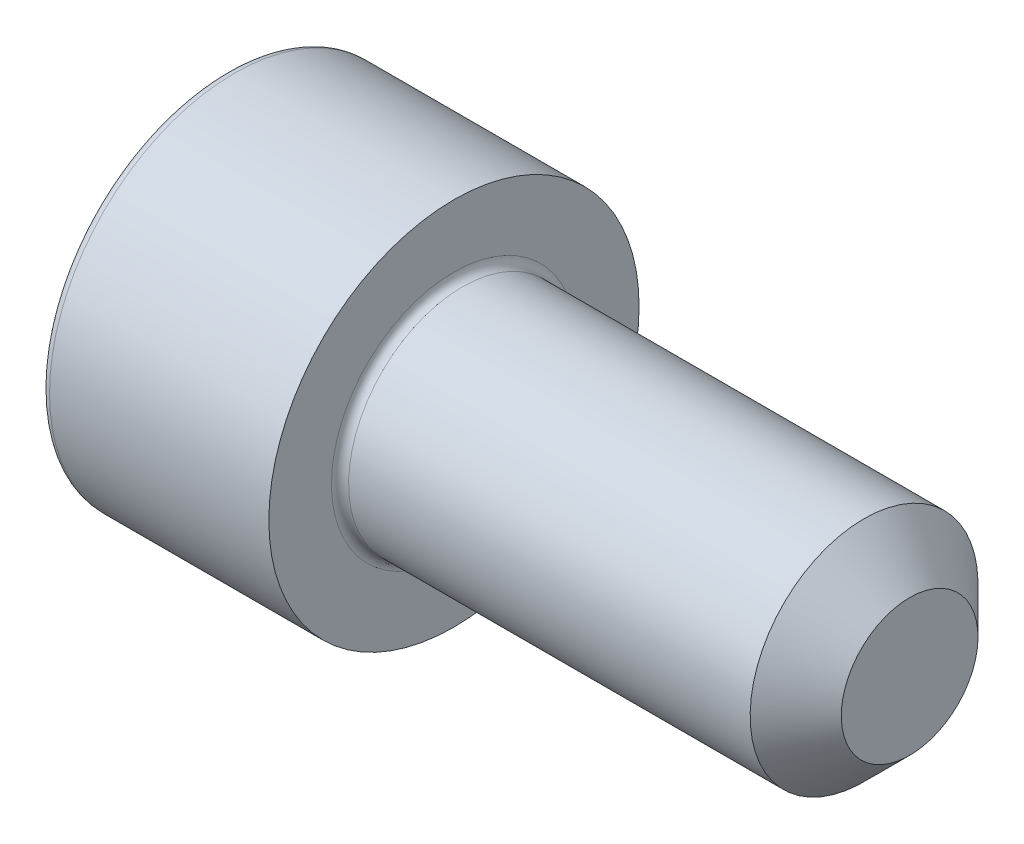
ISO-10303-21;
HEADER;
FILE_DESCRIPTION(('STEP AP214'),'2;1');
FILE_NAME('part.step','',(''),(''),'','','');
FILE_SCHEMA(('AUTOMOTIVE_DESIGN { 1 0 10303 214 1 1 1 1 }'));
ENDSEC;
DATA;
#1=APPLICATION_CONTEXT('core data for automotive mechanical design processes');
#2=APPLICATION_PROTOCOL_DEFINITION('international standard','automotive_design',2000,#1);
#3=PRODUCT_CONTEXT('',#1,'mechanical');
#4=PRODUCT('Part','Part','',(#3));
#5=PRODUCT_RELATED_PRODUCT_CATEGORY('part','',(#4));
#6=PRODUCT_DEFINITION_FORMATION('','',#4);
#7=PRODUCT_DEFINITION_CONTEXT('part definition',#1,'design');
#8=PRODUCT_DEFINITION('design','',#6,#7);
#9=PRODUCT_DEFINITION_SHAPE('','',#8);
#10=(LENGTH_UNIT() NAMED_UNIT(*) SI_UNIT(.MILLI.,.METRE.));
#11=(NAMED_UNIT(*) PLANE_ANGLE_UNIT() SI_UNIT($,.RADIAN.));
#12=(NAMED_UNIT(*) SI_UNIT($,.STERADIAN.) SOLID_ANGLE_UNIT());
#13=UNCERTAINTY_MEASURE_WITH_UNIT(LENGTH_MEASURE(1.E-05),#10,'distance_accuracy_value','');
#14=(GEOMETRIC_REPRESENTATION_CONTEXT(3) GLOBAL_UNCERTAINTY_ASSIGNED_CONTEXT((#13)) GLOBAL_UNIT_ASSIGNED_CONTEXT((#10,
#11,#12)) REPRESENTATION_CONTEXT('',''));
#15=CARTESIAN_POINT('',(0.,0.,0.));
#16=DIRECTION('',(0.,0.,1.));
#17=DIRECTION('',(1.,0.,0.));
#18=AXIS2_PLACEMENT_3D('',#15,#16,#17);
#19=CARTESIAN_POINT('',(0.,0.,0.));
#20=DIRECTION('',(-1.,0.,0.));
#21=DIRECTION('',(0.,-1.,0.));
#22=AXIS2_PLACEMENT_3D('',#19,#20,#21);
#23=PLANE('',#22);
#24=CARTESIAN_POINT('',(0.,0.,0.));
#25=DIRECTION('',(-1.,0.,0.));
#26=DIRECTION('',(0.,-1.,0.));
#27=AXIS2_PLACEMENT_3D('',#24,#25,#26);
#28=CIRCLE('',#27,6.2);
#29=CARTESIAN_POINT('',(0.,-6.2,0.));
#30=VERTEX_POINT('',#29);
#31=EDGE_CURVE('E158',#30,#30,#28,.T.);
#32=ORIENTED_EDGE('',*,*,#31,.T.);
#33=EDGE_LOOP('',(#32));
#34=FACE_BOUND('',#33,.T.);
#35=DIRECTION('',(0.,0.,-1.));
#36=VECTOR('',#35,1.);
#37=CARTESIAN_POINT('',(0.,3.,1.73205080756888));
#38=LINE('',#37,#36);
#39=CARTESIAN_POINT('',(0.,3.,1.73205080756888));
#40=VERTEX_POINT('',#39);
#41=CARTESIAN_POINT('',(0.,3.,-1.73205080756888));
#42=VERTEX_POINT('',#41);
#43=EDGE_CURVE('E54',#40,#42,#38,.T.);
#44=ORIENTED_EDGE('',*,*,#43,.F.);
#45=DIRECTION('',(0.,0.866025403784439,-0.5));
#46=VECTOR('',#45,1.);
#47=CARTESIAN_POINT('',(0.,0.,3.46410161513775));
#48=LINE('',#47,#46);
#49=CARTESIAN_POINT('',(0.,0.,3.46410161513775));
#50=VERTEX_POINT('',#49);
#51=EDGE_CURVE('E137',#50,#40,#48,.T.);
#52=ORIENTED_EDGE('',*,*,#51,.F.);
#53=DIRECTION('',(0.,0.866025403784439,0.5));
#54=VECTOR('',#53,1.);
#55=CARTESIAN_POINT('',(0.,-3.,1.73205080756888));
#56=LINE('',#55,#54);
#57=CARTESIAN_POINT('',(0.,-3.,1.73205080756888));
#58=VERTEX_POINT('',#57);
#59=EDGE_CURVE('E135',#58,#50,#56,.T.);
#60=ORIENTED_EDGE('',*,*,#59,.F.);
#61=DIRECTION('',(0.,0.,1.));
#62=VECTOR('',#61,1.);
#63=CARTESIAN_POINT('',(0.,-3.,-1.73205080756888));
#64=LINE('',#63,#62);
#65=CARTESIAN_POINT('',(0.,-3.,-1.73205080756888));
#66=VERTEX_POINT('',#65);
#67=EDGE_CURVE('E102',#66,#58,#64,.T.);
#68=ORIENTED_EDGE('',*,*,#67,.F.);
#69=DIRECTION('',(0.,-0.866025403784439,0.5));
#70=VECTOR('',#69,1.);
#71=CARTESIAN_POINT('',(0.,0.,-3.46410161513775));
#72=LINE('',#71,#70);
#73=CARTESIAN_POINT('',(0.,0.,-3.46410161513775));
#74=VERTEX_POINT('',#73);
#75=EDGE_CURVE('E131',#74,#66,#72,.T.);
#76=ORIENTED_EDGE('',*,*,#75,.F.);
#77=DIRECTION('',(0.,-0.866025403784438,-0.5));
#78=VECTOR('',#77,1.);
#79=CARTESIAN_POINT('',(0.,3.,-1.73205080756888));
#80=LINE('',#79,#78);
#81=EDGE_CURVE('E128',#42,#74,#80,.T.);
#82=ORIENTED_EDGE('',*,*,#81,.F.);
#83=EDGE_LOOP('',(#44,#52,#60,#68,#76,#82));
#84=FACE_BOUND('',#83,.T.);
#85=ADVANCED_FACE('F38',(#34,#84),#23,.T.);
#86=CARTESIAN_POINT('',(24.,0.,0.));
#87=DIRECTION('',(1.,0.,0.));
#88=DIRECTION('',(0.,1.,0.));
#89=AXIS2_PLACEMENT_3D('',#86,#87,#88);
#90=CYLINDRICAL_SURFACE('',#89,6.5);
#91=CARTESIAN_POINT('',(0.300000000000002,0.,0.));
#92=DIRECTION('',(-1.,0.,0.));
#93=DIRECTION('',(0.,-1.,0.));
#94=AXIS2_PLACEMENT_3D('',#91,#92,#93);
#95=CIRCLE('',#94,6.5);
#96=CARTESIAN_POINT('',(0.300000000000002,-6.5,0.));
#97=VERTEX_POINT('',#96);
#98=EDGE_CURVE('E155',#97,#97,#95,.F.);
#99=ORIENTED_EDGE('',*,*,#98,.T.);
#100=EDGE_LOOP('',(#99));
#101=FACE_BOUND('',#100,.T.);
#102=CARTESIAN_POINT('',(8.,0.,0.));
#103=DIRECTION('',(1.,0.,0.));
#104=DIRECTION('',(0.,1.,0.));
#105=AXIS2_PLACEMENT_3D('',#102,#103,#104);
#106=CIRCLE('',#105,6.49999999999999);
#107=CARTESIAN_POINT('',(8.,6.5,0.));
#108=VERTEX_POINT('',#107);
#109=EDGE_CURVE('E141',#108,#108,#106,.T.);
#110=ORIENTED_EDGE('',*,*,#109,.F.);
#111=EDGE_LOOP('',(#110));
#112=FACE_BOUND('',#111,.T.);
#113=ADVANCED_FACE('F175',(#101,#112),#90,.T.);
#114=CARTESIAN_POINT('',(8.,6.5,0.));
#115=DIRECTION('',(1.,0.,0.));
#116=DIRECTION('',(0.,1.,0.));
#117=AXIS2_PLACEMENT_3D('',#114,#115,#116);
#118=PLANE('',#117);
#119=CARTESIAN_POINT('',(8.,0.,0.));
#120=DIRECTION('',(1.,0.,0.));
#121=DIRECTION('',(0.,1.,0.));
#122=AXIS2_PLACEMENT_3D('',#119,#120,#121);
#123=CIRCLE('',#122,4.29999999999999);
#124=CARTESIAN_POINT('',(8.,4.3,0.));
#125=VERTEX_POINT('',#124);
#126=EDGE_CURVE('E152',#125,#125,#123,.F.);
#127=ORIENTED_EDGE('',*,*,#126,.T.);
#128=EDGE_LOOP('',(#127));
#129=FACE_BOUND('',#128,.T.);
#130=ORIENTED_EDGE('',*,*,#109,.T.);
#131=EDGE_LOOP('',(#130));
#132=FACE_BOUND('',#131,.T.);
#133=ADVANCED_FACE('F181',(#129,#132),#118,.T.);
#134=CARTESIAN_POINT('',(24.,0.,0.));
#135=DIRECTION('',(1.,0.,0.));
#136=DIRECTION('',(0.,1.,0.));
#137=AXIS2_PLACEMENT_3D('',#134,#135,#136);
#138=CYLINDRICAL_SURFACE('',#137,3.99999999999999);
#139=CARTESIAN_POINT('',(22.4,0.,0.));
#140=DIRECTION('',(1.,0.,0.));
#141=DIRECTION('',(0.,1.,0.));
#142=AXIS2_PLACEMENT_3D('',#139,#140,#141);
#143=CIRCLE('',#142,3.99999999999999);
#144=CARTESIAN_POINT('',(22.4,4.,0.));
#145=VERTEX_POINT('',#144);
#146=EDGE_CURVE('E11',#145,#145,#143,.F.);
#147=ORIENTED_EDGE('',*,*,#146,.T.);
#148=EDGE_LOOP('',(#147));
#149=FACE_BOUND('',#148,.T.);
#150=CARTESIAN_POINT('',(8.3,0.,0.));
#151=DIRECTION('',(1.,0.,0.));
#152=DIRECTION('',(0.,1.,0.));
#153=AXIS2_PLACEMENT_3D('',#150,#151,#152);
#154=CIRCLE('',#153,3.99999999999999);
#155=CARTESIAN_POINT('',(8.3,4.,0.));
#156=VERTEX_POINT('',#155);
#157=EDGE_CURVE('E149',#156,#156,#154,.T.);
#158=ORIENTED_EDGE('',*,*,#157,.T.);
#159=EDGE_LOOP('',(#158));
#160=FACE_BOUND('',#159,.T.);
#161=ADVANCED_FACE('F198',(#149,#160),#138,.T.);
#162=CARTESIAN_POINT('',(24.,4.,0.));
#163=DIRECTION('',(1.,0.,0.));
#164=DIRECTION('',(0.,1.,0.));
#165=AXIS2_PLACEMENT_3D('',#162,#163,#164);
#166=PLANE('',#165);
#167=CARTESIAN_POINT('',(24.,0.,0.));
#168=DIRECTION('',(1.,0.,0.));
#169=DIRECTION('',(0.,1.,0.));
#170=AXIS2_PLACEMENT_3D('',#167,#168,#169);
#171=CIRCLE('',#170,2.4);
#172=CARTESIAN_POINT('',(24.,2.4,0.));
#173=VERTEX_POINT('',#172);
#174=EDGE_CURVE('E47',#173,#173,#171,.T.);
#175=ORIENTED_EDGE('',*,*,#174,.T.);
#176=EDGE_LOOP('',(#175));
#177=FACE_BOUND('',#176,.T.);
#178=ADVANCED_FACE('F163',(#177),#166,.T.);
#179=CARTESIAN_POINT('',(2.5,3.,1.73205080756888));
#180=DIRECTION('',(0.,1.,0.));
#181=DIRECTION('',(-1.,0.,0.));
#182=AXIS2_PLACEMENT_3D('',#179,#180,#181);
#183=PLANE('',#182);
#184=ORIENTED_EDGE('',*,*,#43,.T.);
#185=DIRECTION('',(-1.,0.,0.));
#186=VECTOR('',#185,1.);
#187=CARTESIAN_POINT('',(2.5,3.,-1.73205080756888));
#188=LINE('',#187,#186);
#189=CARTESIAN_POINT('',(2.5,3.,-1.73205080756888));
#190=VERTEX_POINT('',#189);
#191=EDGE_CURVE('E84',#190,#42,#188,.T.);
#192=ORIENTED_EDGE('',*,*,#191,.F.);
#193=DIRECTION('',(0.,0.,-1.));
#194=VECTOR('',#193,1.);
#195=CARTESIAN_POINT('',(2.5,3.,1.73205080756888));
#196=LINE('',#195,#194);
#197=CARTESIAN_POINT('',(2.5,3.,1.73205080756888));
#198=VERTEX_POINT('',#197);
#199=EDGE_CURVE('E139',#198,#190,#196,.T.);
#200=ORIENTED_EDGE('',*,*,#199,.F.);
#201=DIRECTION('',(-1.,0.,0.));
#202=VECTOR('',#201,1.);
#203=CARTESIAN_POINT('',(2.5,3.,1.73205080756888));
#204=LINE('',#203,#202);
#205=EDGE_CURVE('E62',#198,#40,#204,.T.);
#206=ORIENTED_EDGE('',*,*,#205,.T.);
#207=EDGE_LOOP('',(#184,#192,#200,#206));
#208=FACE_BOUND('',#207,.T.);
#209=ADVANCED_FACE('F206',(#208),#183,.F.);
#210=CARTESIAN_POINT('',(2.5,0.,3.46410161513775));
#211=DIRECTION('',(0.,0.5,0.866025403784439));
#212=DIRECTION('',(0.,-0.866025403784439,0.5));
#213=AXIS2_PLACEMENT_3D('',#210,#211,#212);
#214=PLANE('',#213);
#215=ORIENTED_EDGE('',*,*,#51,.T.);
#216=ORIENTED_EDGE('',*,*,#205,.F.);
#217=DIRECTION('',(0.,0.866025403784439,-0.5));
#218=VECTOR('',#217,1.);
#219=CARTESIAN_POINT('',(2.5,0.,3.46410161513775));
#220=LINE('',#219,#218);
#221=CARTESIAN_POINT('',(2.5,0.,3.46410161513775));
#222=VERTEX_POINT('',#221);
#223=EDGE_CURVE('E114',#222,#198,#220,.T.);
#224=ORIENTED_EDGE('',*,*,#223,.F.);
#225=DIRECTION('',(-1.,0.,0.));
#226=VECTOR('',#225,1.);
#227=CARTESIAN_POINT('',(2.5,0.,3.46410161513775));
#228=LINE('',#227,#226);
#229=EDGE_CURVE('E106',#222,#50,#228,.T.);
#230=ORIENTED_EDGE('',*,*,#229,.T.);
#231=EDGE_LOOP('',(#215,#216,#224,#230));
#232=FACE_BOUND('',#231,.T.);
#233=ADVANCED_FACE('F212',(#232),#214,.F.);
#234=CARTESIAN_POINT('',(2.5,-3.,1.73205080756888));
#235=DIRECTION('',(0.,-0.5,0.866025403784439));
#236=DIRECTION('',(0.,-0.866025403784439,-0.5));
#237=AXIS2_PLACEMENT_3D('',#234,#235,#236);
#238=PLANE('',#237);
#239=ORIENTED_EDGE('',*,*,#59,.T.);
#240=ORIENTED_EDGE('',*,*,#229,.F.);
#241=DIRECTION('',(0.,0.866025403784439,0.5));
#242=VECTOR('',#241,1.);
#243=CARTESIAN_POINT('',(2.5,-3.,1.73205080756888));
#244=LINE('',#243,#242);
#245=CARTESIAN_POINT('',(2.5,-3.,1.73205080756888));
#246=VERTEX_POINT('',#245);
#247=EDGE_CURVE('E110',#246,#222,#244,.T.);
#248=ORIENTED_EDGE('',*,*,#247,.F.);
#249=DIRECTION('',(-1.,0.,0.));
#250=VECTOR('',#249,1.);
#251=CARTESIAN_POINT('',(2.5,-3.,1.73205080756888));
#252=LINE('',#251,#250);
#253=EDGE_CURVE('E95',#246,#58,#252,.T.);
#254=ORIENTED_EDGE('',*,*,#253,.T.);
#255=EDGE_LOOP('',(#239,#240,#248,#254));
#256=FACE_BOUND('',#255,.T.);
#257=ADVANCED_FACE('F111',(#256),#238,.F.);
#258=CARTESIAN_POINT('',(2.5,-3.,-1.73205080756888));
#259=DIRECTION('',(0.,-1.,0.));
#260=DIRECTION('',(0.,0.,-1.));
#261=AXIS2_PLACEMENT_3D('',#258,#259,#260);
#262=PLANE('',#261);
#263=ORIENTED_EDGE('',*,*,#67,.T.);
#264=ORIENTED_EDGE('',*,*,#253,.F.);
#265=DIRECTION('',(0.,0.,1.));
#266=VECTOR('',#265,1.);
#267=CARTESIAN_POINT('',(2.5,-3.,-1.73205080756888));
#268=LINE('',#267,#266);
#269=CARTESIAN_POINT('',(2.5,-3.,-1.73205080756888));
#270=VERTEX_POINT('',#269);
#271=EDGE_CURVE('E99',#270,#246,#268,.T.);
#272=ORIENTED_EDGE('',*,*,#271,.F.);
#273=DIRECTION('',(-1.,0.,0.));
#274=VECTOR('',#273,1.);
#275=CARTESIAN_POINT('',(2.5,-3.,-1.73205080756888));
#276=LINE('',#275,#274);
#277=EDGE_CURVE('E107',#270,#66,#276,.T.);
#278=ORIENTED_EDGE('',*,*,#277,.T.);
#279=EDGE_LOOP('',(#263,#264,#272,#278));
#280=FACE_BOUND('',#279,.T.);
#281=ADVANCED_FACE('F97',(#280),#262,.F.);
#282=CARTESIAN_POINT('',(2.5,0.,-3.46410161513775));
#283=DIRECTION('',(0.,-0.5,-0.866025403784439));
#284=DIRECTION('',(0.,0.866025403784439,-0.5));
#285=AXIS2_PLACEMENT_3D('',#282,#283,#284);
#286=PLANE('',#285);
#287=ORIENTED_EDGE('',*,*,#75,.T.);
#288=ORIENTED_EDGE('',*,*,#277,.F.);
#289=DIRECTION('',(0.,-0.866025403784439,0.5));
#290=VECTOR('',#289,1.);
#291=CARTESIAN_POINT('',(2.5,0.,-3.46410161513775));
#292=LINE('',#291,#290);
#293=CARTESIAN_POINT('',(2.5,0.,-3.46410161513775));
#294=VERTEX_POINT('',#293);
#295=EDGE_CURVE('E120',#294,#270,#292,.T.);
#296=ORIENTED_EDGE('',*,*,#295,.F.);
#297=DIRECTION('',(-1.,0.,0.));
#298=VECTOR('',#297,1.);
#299=CARTESIAN_POINT('',(2.5,0.,-3.46410161513775));
#300=LINE('',#299,#298);
#301=EDGE_CURVE('E144',#294,#74,#300,.T.);
#302=ORIENTED_EDGE('',*,*,#301,.T.);
#303=EDGE_LOOP('',(#287,#288,#296,#302));
#304=FACE_BOUND('',#303,.T.);
#305=ADVANCED_FACE('F215',(#304),#286,.F.);
#306=CARTESIAN_POINT('',(2.5,3.,-1.73205080756888));
#307=DIRECTION('',(0.,0.5,-0.866025403784439));
#308=DIRECTION('',(0.,0.866025403784439,0.5));
#309=AXIS2_PLACEMENT_3D('',#306,#307,#308);
#310=PLANE('',#309);
#311=ORIENTED_EDGE('',*,*,#81,.T.);
#312=ORIENTED_EDGE('',*,*,#301,.F.);
#313=DIRECTION('',(0.,-0.866025403784438,-0.5));
#314=VECTOR('',#313,1.);
#315=CARTESIAN_POINT('',(2.5,3.,-1.73205080756888));
#316=LINE('',#315,#314);
#317=EDGE_CURVE('E122',#190,#294,#316,.T.);
#318=ORIENTED_EDGE('',*,*,#317,.F.);
#319=ORIENTED_EDGE('',*,*,#191,.T.);
#320=EDGE_LOOP('',(#311,#312,#318,#319));
#321=FACE_BOUND('',#320,.T.);
#322=ADVANCED_FACE('F192',(#321),#310,.F.);
#323=CARTESIAN_POINT('',(2.5,0.,0.));
#324=DIRECTION('',(-1.,0.,0.));
#325=DIRECTION('',(0.,-1.,0.));
#326=AXIS2_PLACEMENT_3D('',#323,#324,#325);
#327=PLANE('',#326);
#328=ORIENTED_EDGE('',*,*,#199,.T.);
#329=ORIENTED_EDGE('',*,*,#317,.T.);
#330=ORIENTED_EDGE('',*,*,#295,.T.);
#331=ORIENTED_EDGE('',*,*,#271,.T.);
#332=ORIENTED_EDGE('',*,*,#247,.T.);
#333=ORIENTED_EDGE('',*,*,#223,.T.);
#334=EDGE_LOOP('',(#328,#329,#330,#331,#332,#333));
#335=FACE_BOUND('',#334,.T.);
#336=ADVANCED_FACE('F117',(#335),#327,.T.);
#337=CARTESIAN_POINT('',(8.3,0.,0.));
#338=DIRECTION('',(1.,0.,0.));
#339=DIRECTION('',(0.,1.,0.));
#340=AXIS2_PLACEMENT_3D('',#337,#338,#339);
#341=TOROIDAL_SURFACE('',#340,4.29999999999999,0.3);
#342=ORIENTED_EDGE('',*,*,#126,.F.);
#343=EDGE_LOOP('',(#342));
#344=FACE_BOUND('',#343,.T.);
#345=ORIENTED_EDGE('',*,*,#157,.F.);
#346=EDGE_LOOP('',(#345));
#347=FACE_BOUND('',#346,.T.);
#348=ADVANCED_FACE('F171',(#344,#347),#341,.F.);
#349=CARTESIAN_POINT('',(0.300000000000002,0.,0.));
#350=DIRECTION('',(-1.,0.,0.));
#351=DIRECTION('',(0.,-1.,0.));
#352=AXIS2_PLACEMENT_3D('',#349,#350,#351);
#353=TOROIDAL_SURFACE('',#352,6.2,0.3);
#354=ORIENTED_EDGE('',*,*,#31,.F.);
#355=EDGE_LOOP('',(#354));
#356=FACE_BOUND('',#355,.T.);
#357=ORIENTED_EDGE('',*,*,#98,.F.);
#358=EDGE_LOOP('',(#357));
#359=FACE_BOUND('',#358,.T.);
#360=ADVANCED_FACE('F166',(#356,#359),#353,.T.);
#361=CARTESIAN_POINT('',(24.,0.,0.));
#362=DIRECTION('',(-1.,0.,0.));
#363=DIRECTION('',(0.,-1.,0.));
#364=AXIS2_PLACEMENT_3D('',#361,#362,#363);
#365=CONICAL_SURFACE('',#364,2.4,0.785398163397447);
#366=ORIENTED_EDGE('',*,*,#146,.F.);
#367=EDGE_LOOP('',(#366));
#368=FACE_BOUND('',#367,.T.);
#369=ORIENTED_EDGE('',*,*,#174,.F.);
#370=EDGE_LOOP('',(#369));
#371=FACE_BOUND('',#370,.T.);
#372=ADVANCED_FACE('F41',(#368,#371),#365,.T.);
#373=CLOSED_SHELL('',(#85,#113,#133,#161,#178,#209,#233,#257,#281,#305,#322,#336,#348,#360,#372));
#374=MANIFOLD_SOLID_BREP('B2',#373);
#375=ADVANCED_BREP_SHAPE_REPRESENTATION('',(#18,#374),#14);
#376=SHAPE_DEFINITION_REPRESENTATION(#9,#375);
ENDSEC;
END-ISO-10303-21;
